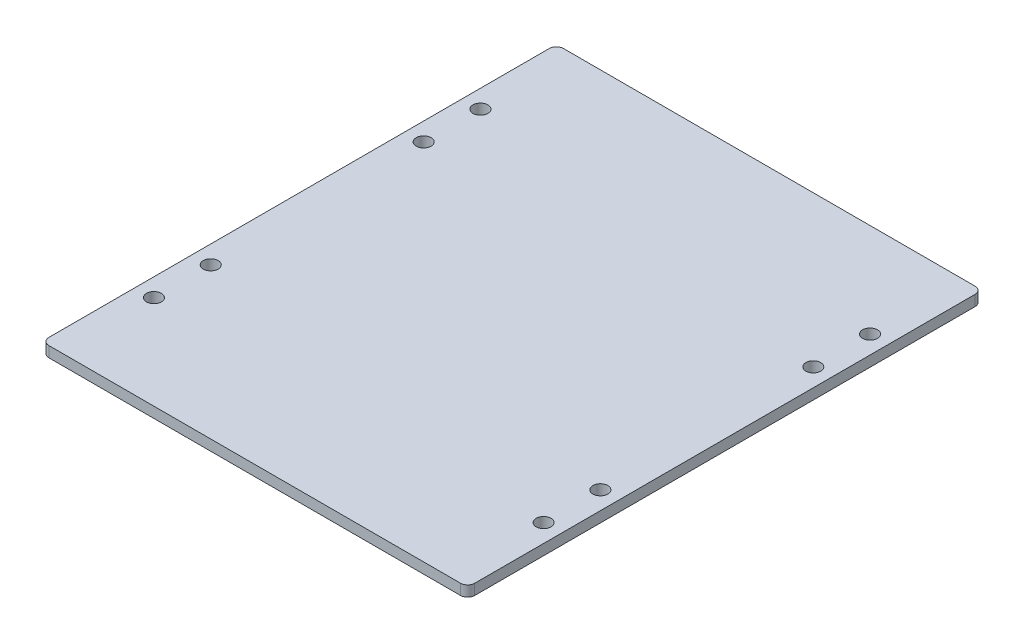
ISO-10303-21;
HEADER;
FILE_DESCRIPTION(('STEP AP214'),'2;1');
FILE_NAME('part.step','',(''),(''),'','','');
FILE_SCHEMA(('AUTOMOTIVE_DESIGN { 1 0 10303 214 1 1 1 1 }'));
ENDSEC;
DATA;
#1=APPLICATION_CONTEXT('core data for automotive mechanical design processes');
#2=APPLICATION_PROTOCOL_DEFINITION('international standard','automotive_design',2000,#1);
#3=PRODUCT_CONTEXT('',#1,'mechanical');
#4=PRODUCT('Part','Part','',(#3));
#5=PRODUCT_RELATED_PRODUCT_CATEGORY('part','',(#4));
#6=PRODUCT_DEFINITION_FORMATION('','',#4);
#7=PRODUCT_DEFINITION_CONTEXT('part definition',#1,'design');
#8=PRODUCT_DEFINITION('design','',#6,#7);
#9=PRODUCT_DEFINITION_SHAPE('','',#8);
#10=(LENGTH_UNIT() NAMED_UNIT(*) SI_UNIT(.MILLI.,.METRE.));
#11=(NAMED_UNIT(*) PLANE_ANGLE_UNIT() SI_UNIT($,.RADIAN.));
#12=(NAMED_UNIT(*) SI_UNIT($,.STERADIAN.) SOLID_ANGLE_UNIT());
#13=UNCERTAINTY_MEASURE_WITH_UNIT(LENGTH_MEASURE(1.E-05),#10,'distance_accuracy_value','');
#14=(GEOMETRIC_REPRESENTATION_CONTEXT(3) GLOBAL_UNCERTAINTY_ASSIGNED_CONTEXT((#13)) GLOBAL_UNIT_ASSIGNED_CONTEXT((#10,
#11,#12)) REPRESENTATION_CONTEXT('',''));
#15=CARTESIAN_POINT('',(0.,0.,0.));
#16=DIRECTION('',(0.,0.,1.));
#17=DIRECTION('',(1.,0.,0.));
#18=AXIS2_PLACEMENT_3D('',#15,#16,#17);
#19=CARTESIAN_POINT('',(0.,3.,0.));
#20=DIRECTION('',(1.,0.,0.));
#21=DIRECTION('',(0.,0.,-1.));
#22=AXIS2_PLACEMENT_3D('',#19,#20,#21);
#23=PLANE('',#22);
#24=DIRECTION('',(0.,0.,1.));
#25=VECTOR('',#24,1.);
#26=CARTESIAN_POINT('',(0.,3.,0.));
#27=LINE('',#26,#25);
#28=CARTESIAN_POINT('',(0.,3.,-143.));
#29=VERTEX_POINT('',#28);
#30=CARTESIAN_POINT('',(0.,3.,-2.));
#31=VERTEX_POINT('',#30);
#32=EDGE_CURVE('E117',#29,#31,#27,.T.);
#33=ORIENTED_EDGE('',*,*,#32,.F.);
#34=DIRECTION('',(0.,-1.,0.));
#35=VECTOR('',#34,1.);
#36=CARTESIAN_POINT('',(0.,3.,-143.));
#37=LINE('',#36,#35);
#38=CARTESIAN_POINT('',(0.,0.,-143.));
#39=VERTEX_POINT('',#38);
#40=EDGE_CURVE('E102',#29,#39,#37,.T.);
#41=ORIENTED_EDGE('',*,*,#40,.T.);
#42=DIRECTION('',(0.,0.,1.));
#43=VECTOR('',#42,1.);
#44=CARTESIAN_POINT('',(0.,0.,0.));
#45=LINE('',#44,#43);
#46=CARTESIAN_POINT('',(0.,0.,-2.));
#47=VERTEX_POINT('',#46);
#48=EDGE_CURVE('E114',#39,#47,#45,.T.);
#49=ORIENTED_EDGE('',*,*,#48,.T.);
#50=DIRECTION('',(0.,-1.,0.));
#51=VECTOR('',#50,1.);
#52=CARTESIAN_POINT('',(0.,3.,-2.));
#53=LINE('',#52,#51);
#54=EDGE_CURVE('E119',#47,#31,#53,.F.);
#55=ORIENTED_EDGE('',*,*,#54,.T.);
#56=EDGE_LOOP('',(#33,#41,#49,#55));
#57=FACE_BOUND('',#56,.T.);
#58=ADVANCED_FACE('F32',(#57),#23,.F.);
#59=CARTESIAN_POINT('',(0.,3.,0.));
#60=DIRECTION('',(0.,0.,-1.));
#61=DIRECTION('',(-1.,0.,0.));
#62=AXIS2_PLACEMENT_3D('',#59,#60,#61);
#63=PLANE('',#62);
#64=DIRECTION('',(1.,0.,0.));
#65=VECTOR('',#64,1.);
#66=CARTESIAN_POINT('',(0.,0.,0.));
#67=LINE('',#66,#65);
#68=CARTESIAN_POINT('',(2.,0.,0.));
#69=VERTEX_POINT('',#68);
#70=CARTESIAN_POINT('',(118.,0.,0.));
#71=VERTEX_POINT('',#70);
#72=EDGE_CURVE('E123',#69,#71,#67,.T.);
#73=ORIENTED_EDGE('',*,*,#72,.T.);
#74=DIRECTION('',(0.,-1.,0.));
#75=VECTOR('',#74,1.);
#76=CARTESIAN_POINT('',(118.,3.,0.));
#77=LINE('',#76,#75);
#78=CARTESIAN_POINT('',(118.,3.,0.));
#79=VERTEX_POINT('',#78);
#80=EDGE_CURVE('E11',#71,#79,#77,.F.);
#81=ORIENTED_EDGE('',*,*,#80,.T.);
#82=DIRECTION('',(1.,0.,0.));
#83=VECTOR('',#82,1.);
#84=CARTESIAN_POINT('',(0.,3.,0.));
#85=LINE('',#84,#83);
#86=CARTESIAN_POINT('',(2.,3.,0.));
#87=VERTEX_POINT('',#86);
#88=EDGE_CURVE('E163',#87,#79,#85,.T.);
#89=ORIENTED_EDGE('',*,*,#88,.F.);
#90=DIRECTION('',(0.,-1.,0.));
#91=VECTOR('',#90,1.);
#92=CARTESIAN_POINT('',(2.,3.,0.));
#93=LINE('',#92,#91);
#94=EDGE_CURVE('E40',#87,#69,#93,.T.);
#95=ORIENTED_EDGE('',*,*,#94,.T.);
#96=EDGE_LOOP('',(#73,#81,#89,#95));
#97=FACE_BOUND('',#96,.T.);
#98=ADVANCED_FACE('F161',(#97),#63,.F.);
#99=CARTESIAN_POINT('',(120.,3.,0.));
#100=DIRECTION('',(-1.,0.,0.));
#101=DIRECTION('',(0.,0.,1.));
#102=AXIS2_PLACEMENT_3D('',#99,#100,#101);
#103=PLANE('',#102);
#104=DIRECTION('',(0.,0.,-1.));
#105=VECTOR('',#104,1.);
#106=CARTESIAN_POINT('',(120.,0.,0.));
#107=LINE('',#106,#105);
#108=CARTESIAN_POINT('',(120.,0.,-2.));
#109=VERTEX_POINT('',#108);
#110=CARTESIAN_POINT('',(120.,0.,-143.));
#111=VERTEX_POINT('',#110);
#112=EDGE_CURVE('E127',#109,#111,#107,.T.);
#113=ORIENTED_EDGE('',*,*,#112,.T.);
#114=DIRECTION('',(0.,-1.,0.));
#115=VECTOR('',#114,1.);
#116=CARTESIAN_POINT('',(120.,3.,-143.));
#117=LINE('',#116,#115);
#118=CARTESIAN_POINT('',(120.,3.,-143.));
#119=VERTEX_POINT('',#118);
#120=EDGE_CURVE('E47',#111,#119,#117,.F.);
#121=ORIENTED_EDGE('',*,*,#120,.T.);
#122=DIRECTION('',(0.,0.,-1.));
#123=VECTOR('',#122,1.);
#124=CARTESIAN_POINT('',(120.,3.,0.));
#125=LINE('',#124,#123);
#126=CARTESIAN_POINT('',(120.,3.,-2.));
#127=VERTEX_POINT('',#126);
#128=EDGE_CURVE('E171',#127,#119,#125,.T.);
#129=ORIENTED_EDGE('',*,*,#128,.F.);
#130=DIRECTION('',(0.,-1.,0.));
#131=VECTOR('',#130,1.);
#132=CARTESIAN_POINT('',(120.,3.,-2.));
#133=LINE('',#132,#131);
#134=EDGE_CURVE('E154',#127,#109,#133,.T.);
#135=ORIENTED_EDGE('',*,*,#134,.T.);
#136=EDGE_LOOP('',(#113,#121,#129,#135));
#137=FACE_BOUND('',#136,.T.);
#138=ADVANCED_FACE('F170',(#137),#103,.F.);
#139=CARTESIAN_POINT('',(0.,3.,-145.));
#140=DIRECTION('',(0.,0.,1.));
#141=DIRECTION('',(1.,0.,0.));
#142=AXIS2_PLACEMENT_3D('',#139,#140,#141);
#143=PLANE('',#142);
#144=DIRECTION('',(-1.,0.,0.));
#145=VECTOR('',#144,1.);
#146=CARTESIAN_POINT('',(0.,0.,-145.));
#147=LINE('',#146,#145);
#148=CARTESIAN_POINT('',(118.,0.,-145.));
#149=VERTEX_POINT('',#148);
#150=CARTESIAN_POINT('',(2.,0.,-145.));
#151=VERTEX_POINT('',#150);
#152=EDGE_CURVE('E137',#149,#151,#147,.T.);
#153=ORIENTED_EDGE('',*,*,#152,.T.);
#154=DIRECTION('',(0.,-1.,0.));
#155=VECTOR('',#154,1.);
#156=CARTESIAN_POINT('',(2.,3.,-145.));
#157=LINE('',#156,#155);
#158=CARTESIAN_POINT('',(2.,3.,-145.));
#159=VERTEX_POINT('',#158);
#160=EDGE_CURVE('E103',#151,#159,#157,.F.);
#161=ORIENTED_EDGE('',*,*,#160,.T.);
#162=DIRECTION('',(-1.,0.,0.));
#163=VECTOR('',#162,1.);
#164=CARTESIAN_POINT('',(0.,3.,-145.));
#165=LINE('',#164,#163);
#166=CARTESIAN_POINT('',(118.,3.,-145.));
#167=VERTEX_POINT('',#166);
#168=EDGE_CURVE('E133',#167,#159,#165,.T.);
#169=ORIENTED_EDGE('',*,*,#168,.F.);
#170=DIRECTION('',(0.,-1.,0.));
#171=VECTOR('',#170,1.);
#172=CARTESIAN_POINT('',(118.,3.,-145.));
#173=LINE('',#172,#171);
#174=EDGE_CURVE('E108',#167,#149,#173,.T.);
#175=ORIENTED_EDGE('',*,*,#174,.T.);
#176=EDGE_LOOP('',(#153,#161,#169,#175));
#177=FACE_BOUND('',#176,.T.);
#178=ADVANCED_FACE('F235',(#177),#143,.F.);
#179=CARTESIAN_POINT('',(0.,3.,0.));
#180=DIRECTION('',(0.,-1.,0.));
#181=DIRECTION('',(0.,0.,-1.));
#182=AXIS2_PLACEMENT_3D('',#179,#180,#181);
#183=PLANE('',#182);
#184=CARTESIAN_POINT('',(5.09999999999999,3.,-102.5));
#185=DIRECTION('',(0.,1.,0.));
#186=DIRECTION('',(0.,0.,1.));
#187=AXIS2_PLACEMENT_3D('',#184,#185,#186);
#188=CIRCLE('',#187,2.10000000000001);
#189=CARTESIAN_POINT('',(5.09999999999999,3.,-100.4));
#190=VERTEX_POINT('',#189);
#191=EDGE_CURVE('E199',#190,#190,#188,.T.);
#192=ORIENTED_EDGE('',*,*,#191,.F.);
#193=EDGE_LOOP('',(#192));
#194=FACE_BOUND('',#193,.T.);
#195=CARTESIAN_POINT('',(5.10000000000001,3.,-42.5));
#196=DIRECTION('',(0.,1.,0.));
#197=DIRECTION('',(0.,0.,1.));
#198=AXIS2_PLACEMENT_3D('',#195,#196,#197);
#199=CIRCLE('',#198,2.1);
#200=CARTESIAN_POINT('',(5.10000000000001,3.,-40.4));
#201=VERTEX_POINT('',#200);
#202=EDGE_CURVE('E193',#201,#201,#199,.T.);
#203=ORIENTED_EDGE('',*,*,#202,.F.);
#204=EDGE_LOOP('',(#203));
#205=FACE_BOUND('',#204,.T.);
#206=CARTESIAN_POINT('',(5.1,3.,-26.5));
#207=DIRECTION('',(0.,1.,0.));
#208=DIRECTION('',(0.,0.,1.));
#209=AXIS2_PLACEMENT_3D('',#206,#207,#208);
#210=CIRCLE('',#209,2.1);
#211=CARTESIAN_POINT('',(5.1,3.,-24.4));
#212=VERTEX_POINT('',#211);
#213=EDGE_CURVE('E187',#212,#212,#210,.T.);
#214=ORIENTED_EDGE('',*,*,#213,.F.);
#215=EDGE_LOOP('',(#214));
#216=FACE_BOUND('',#215,.T.);
#217=CARTESIAN_POINT('',(114.9,3.,-26.5));
#218=DIRECTION('',(0.,1.,0.));
#219=DIRECTION('',(0.,0.,1.));
#220=AXIS2_PLACEMENT_3D('',#217,#218,#219);
#221=CIRCLE('',#220,2.1);
#222=CARTESIAN_POINT('',(114.9,3.,-24.4));
#223=VERTEX_POINT('',#222);
#224=EDGE_CURVE('E180',#223,#223,#221,.T.);
#225=ORIENTED_EDGE('',*,*,#224,.F.);
#226=EDGE_LOOP('',(#225));
#227=FACE_BOUND('',#226,.T.);
#228=CARTESIAN_POINT('',(114.9,3.,-42.5));
#229=DIRECTION('',(0.,1.,0.));
#230=DIRECTION('',(0.,0.,1.));
#231=AXIS2_PLACEMENT_3D('',#228,#229,#230);
#232=CIRCLE('',#231,2.1);
#233=CARTESIAN_POINT('',(114.9,3.,-40.4));
#234=VERTEX_POINT('',#233);
#235=EDGE_CURVE('E216',#234,#234,#232,.T.);
#236=ORIENTED_EDGE('',*,*,#235,.F.);
#237=EDGE_LOOP('',(#236));
#238=FACE_BOUND('',#237,.T.);
#239=CARTESIAN_POINT('',(114.9,3.,-102.5));
#240=DIRECTION('',(0.,1.,0.));
#241=DIRECTION('',(0.,0.,1.));
#242=AXIS2_PLACEMENT_3D('',#239,#240,#241);
#243=CIRCLE('',#242,2.1);
#244=CARTESIAN_POINT('',(114.9,3.,-100.4));
#245=VERTEX_POINT('',#244);
#246=EDGE_CURVE('E210',#245,#245,#243,.T.);
#247=ORIENTED_EDGE('',*,*,#246,.F.);
#248=EDGE_LOOP('',(#247));
#249=FACE_BOUND('',#248,.T.);
#250=CARTESIAN_POINT('',(114.9,3.,-118.5));
#251=DIRECTION('',(0.,1.,0.));
#252=DIRECTION('',(0.,0.,1.));
#253=AXIS2_PLACEMENT_3D('',#250,#251,#252);
#254=CIRCLE('',#253,2.1);
#255=CARTESIAN_POINT('',(114.9,3.,-116.4));
#256=VERTEX_POINT('',#255);
#257=EDGE_CURVE('E204',#256,#256,#254,.T.);
#258=ORIENTED_EDGE('',*,*,#257,.F.);
#259=EDGE_LOOP('',(#258));
#260=FACE_BOUND('',#259,.T.);
#261=CARTESIAN_POINT('',(5.1,3.,-118.5));
#262=DIRECTION('',(0.,1.,0.));
#263=DIRECTION('',(0.,0.,1.));
#264=AXIS2_PLACEMENT_3D('',#261,#262,#263);
#265=CIRCLE('',#264,2.1);
#266=CARTESIAN_POINT('',(5.1,3.,-116.4));
#267=VERTEX_POINT('',#266);
#268=EDGE_CURVE('E130',#267,#267,#265,.T.);
#269=ORIENTED_EDGE('',*,*,#268,.F.);
#270=EDGE_LOOP('',(#269));
#271=FACE_BOUND('',#270,.T.);
#272=ORIENTED_EDGE('',*,*,#168,.T.);
#273=CARTESIAN_POINT('',(2.,3.,-143.));
#274=DIRECTION('',(0.,-1.,0.));
#275=DIRECTION('',(0.,0.,-1.));
#276=AXIS2_PLACEMENT_3D('',#273,#274,#275);
#277=CIRCLE('',#276,2.);
#278=EDGE_CURVE('E152',#159,#29,#277,.F.);
#279=ORIENTED_EDGE('',*,*,#278,.T.);
#280=ORIENTED_EDGE('',*,*,#32,.T.);
#281=CARTESIAN_POINT('',(2.,3.,-2.));
#282=DIRECTION('',(0.,-1.,0.));
#283=DIRECTION('',(0.,0.,-1.));
#284=AXIS2_PLACEMENT_3D('',#281,#282,#283);
#285=CIRCLE('',#284,2.);
#286=EDGE_CURVE('E147',#31,#87,#285,.F.);
#287=ORIENTED_EDGE('',*,*,#286,.T.);
#288=ORIENTED_EDGE('',*,*,#88,.T.);
#289=CARTESIAN_POINT('',(118.,3.,-2.));
#290=DIRECTION('',(0.,-1.,0.));
#291=DIRECTION('',(0.,0.,-1.));
#292=AXIS2_PLACEMENT_3D('',#289,#290,#291);
#293=CIRCLE('',#292,2.);
#294=EDGE_CURVE('E54',#79,#127,#293,.F.);
#295=ORIENTED_EDGE('',*,*,#294,.T.);
#296=ORIENTED_EDGE('',*,*,#128,.T.);
#297=CARTESIAN_POINT('',(118.,3.,-143.));
#298=DIRECTION('',(0.,-1.,0.));
#299=DIRECTION('',(0.,0.,-1.));
#300=AXIS2_PLACEMENT_3D('',#297,#298,#299);
#301=CIRCLE('',#300,2.);
#302=EDGE_CURVE('E150',#119,#167,#301,.F.);
#303=ORIENTED_EDGE('',*,*,#302,.T.);
#304=EDGE_LOOP('',(#272,#279,#280,#287,#288,#295,#296,#303));
#305=FACE_BOUND('',#304,.T.);
#306=ADVANCED_FACE('F232',(#194,#205,#216,#227,#238,#249,#260,#271,#305),#183,.F.);
#307=CARTESIAN_POINT('',(0.,0.,0.));
#308=DIRECTION('',(0.,-1.,0.));
#309=DIRECTION('',(0.,0.,-1.));
#310=AXIS2_PLACEMENT_3D('',#307,#308,#309);
#311=PLANE('',#310);
#312=CARTESIAN_POINT('',(5.09999999999999,0.,-102.5));
#313=DIRECTION('',(0.,1.,0.));
#314=DIRECTION('',(0.,0.,1.));
#315=AXIS2_PLACEMENT_3D('',#312,#313,#314);
#316=CIRCLE('',#315,2.10000000000001);
#317=CARTESIAN_POINT('',(5.09999999999999,0.,-100.4));
#318=VERTEX_POINT('',#317);
#319=EDGE_CURVE('E178',#318,#318,#316,.T.);
#320=ORIENTED_EDGE('',*,*,#319,.T.);
#321=EDGE_LOOP('',(#320));
#322=FACE_BOUND('',#321,.T.);
#323=CARTESIAN_POINT('',(5.10000000000001,0.,-42.5));
#324=DIRECTION('',(0.,1.,0.));
#325=DIRECTION('',(0.,0.,1.));
#326=AXIS2_PLACEMENT_3D('',#323,#324,#325);
#327=CIRCLE('',#326,2.1);
#328=CARTESIAN_POINT('',(5.10000000000001,0.,-40.4));
#329=VERTEX_POINT('',#328);
#330=EDGE_CURVE('E196',#329,#329,#327,.T.);
#331=ORIENTED_EDGE('',*,*,#330,.T.);
#332=EDGE_LOOP('',(#331));
#333=FACE_BOUND('',#332,.T.);
#334=CARTESIAN_POINT('',(5.1,0.,-26.5));
#335=DIRECTION('',(0.,1.,0.));
#336=DIRECTION('',(0.,0.,1.));
#337=AXIS2_PLACEMENT_3D('',#334,#335,#336);
#338=CIRCLE('',#337,2.1);
#339=CARTESIAN_POINT('',(5.1,0.,-24.4));
#340=VERTEX_POINT('',#339);
#341=EDGE_CURVE('E190',#340,#340,#338,.T.);
#342=ORIENTED_EDGE('',*,*,#341,.T.);
#343=EDGE_LOOP('',(#342));
#344=FACE_BOUND('',#343,.T.);
#345=CARTESIAN_POINT('',(114.9,0.,-26.5));
#346=DIRECTION('',(0.,1.,0.));
#347=DIRECTION('',(0.,0.,1.));
#348=AXIS2_PLACEMENT_3D('',#345,#346,#347);
#349=CIRCLE('',#348,2.1);
#350=CARTESIAN_POINT('',(114.9,0.,-24.4));
#351=VERTEX_POINT('',#350);
#352=EDGE_CURVE('E183',#351,#351,#349,.T.);
#353=ORIENTED_EDGE('',*,*,#352,.T.);
#354=EDGE_LOOP('',(#353));
#355=FACE_BOUND('',#354,.T.);
#356=CARTESIAN_POINT('',(114.9,0.,-42.5));
#357=DIRECTION('',(0.,1.,0.));
#358=DIRECTION('',(0.,0.,1.));
#359=AXIS2_PLACEMENT_3D('',#356,#357,#358);
#360=CIRCLE('',#359,2.1);
#361=CARTESIAN_POINT('',(114.9,0.,-40.4));
#362=VERTEX_POINT('',#361);
#363=EDGE_CURVE('E184',#362,#362,#360,.T.);
#364=ORIENTED_EDGE('',*,*,#363,.T.);
#365=EDGE_LOOP('',(#364));
#366=FACE_BOUND('',#365,.T.);
#367=CARTESIAN_POINT('',(114.9,0.,-102.5));
#368=DIRECTION('',(0.,1.,0.));
#369=DIRECTION('',(0.,0.,1.));
#370=AXIS2_PLACEMENT_3D('',#367,#368,#369);
#371=CIRCLE('',#370,2.1);
#372=CARTESIAN_POINT('',(114.9,0.,-100.4));
#373=VERTEX_POINT('',#372);
#374=EDGE_CURVE('E213',#373,#373,#371,.T.);
#375=ORIENTED_EDGE('',*,*,#374,.T.);
#376=EDGE_LOOP('',(#375));
#377=FACE_BOUND('',#376,.T.);
#378=CARTESIAN_POINT('',(114.9,0.,-118.5));
#379=DIRECTION('',(0.,1.,0.));
#380=DIRECTION('',(0.,0.,1.));
#381=AXIS2_PLACEMENT_3D('',#378,#379,#380);
#382=CIRCLE('',#381,2.1);
#383=CARTESIAN_POINT('',(114.9,0.,-116.4));
#384=VERTEX_POINT('',#383);
#385=EDGE_CURVE('E207',#384,#384,#382,.T.);
#386=ORIENTED_EDGE('',*,*,#385,.T.);
#387=EDGE_LOOP('',(#386));
#388=FACE_BOUND('',#387,.T.);
#389=CARTESIAN_POINT('',(5.1,0.,-118.5));
#390=DIRECTION('',(0.,1.,0.));
#391=DIRECTION('',(0.,0.,1.));
#392=AXIS2_PLACEMENT_3D('',#389,#390,#391);
#393=CIRCLE('',#392,2.1);
#394=CARTESIAN_POINT('',(5.1,0.,-116.4));
#395=VERTEX_POINT('',#394);
#396=EDGE_CURVE('E124',#395,#395,#393,.T.);
#397=ORIENTED_EDGE('',*,*,#396,.T.);
#398=EDGE_LOOP('',(#397));
#399=FACE_BOUND('',#398,.T.);
#400=ORIENTED_EDGE('',*,*,#48,.F.);
#401=CARTESIAN_POINT('',(2.,0.,-143.));
#402=DIRECTION('',(0.,-1.,0.));
#403=DIRECTION('',(0.,0.,-1.));
#404=AXIS2_PLACEMENT_3D('',#401,#402,#403);
#405=CIRCLE('',#404,2.);
#406=EDGE_CURVE('E98',#39,#151,#405,.T.);
#407=ORIENTED_EDGE('',*,*,#406,.T.);
#408=ORIENTED_EDGE('',*,*,#152,.F.);
#409=CARTESIAN_POINT('',(118.,0.,-143.));
#410=DIRECTION('',(0.,-1.,0.));
#411=DIRECTION('',(0.,0.,-1.));
#412=AXIS2_PLACEMENT_3D('',#409,#410,#411);
#413=CIRCLE('',#412,2.);
#414=EDGE_CURVE('E109',#149,#111,#413,.T.);
#415=ORIENTED_EDGE('',*,*,#414,.T.);
#416=ORIENTED_EDGE('',*,*,#112,.F.);
#417=CARTESIAN_POINT('',(118.,0.,-2.));
#418=DIRECTION('',(0.,-1.,0.));
#419=DIRECTION('',(0.,0.,-1.));
#420=AXIS2_PLACEMENT_3D('',#417,#418,#419);
#421=CIRCLE('',#420,2.);
#422=EDGE_CURVE('E141',#109,#71,#421,.T.);
#423=ORIENTED_EDGE('',*,*,#422,.T.);
#424=ORIENTED_EDGE('',*,*,#72,.F.);
#425=CARTESIAN_POINT('',(2.,0.,-2.));
#426=DIRECTION('',(0.,-1.,0.));
#427=DIRECTION('',(0.,0.,-1.));
#428=AXIS2_PLACEMENT_3D('',#425,#426,#427);
#429=CIRCLE('',#428,2.);
#430=EDGE_CURVE('E118',#69,#47,#429,.T.);
#431=ORIENTED_EDGE('',*,*,#430,.T.);
#432=EDGE_LOOP('',(#400,#407,#408,#415,#416,#423,#424,#431));
#433=FACE_BOUND('',#432,.T.);
#434=ADVANCED_FACE('F121',(#322,#333,#344,#355,#366,#377,#388,#399,#433),#311,.T.);
#435=CARTESIAN_POINT('',(5.1,0.,-118.5));
#436=DIRECTION('',(0.,1.,0.));
#437=DIRECTION('',(0.,0.,1.));
#438=AXIS2_PLACEMENT_3D('',#435,#436,#437);
#439=CYLINDRICAL_SURFACE('',#438,2.1);
#440=ORIENTED_EDGE('',*,*,#396,.F.);
#441=EDGE_LOOP('',(#440));
#442=FACE_BOUND('',#441,.T.);
#443=ORIENTED_EDGE('',*,*,#268,.T.);
#444=EDGE_LOOP('',(#443));
#445=FACE_BOUND('',#444,.T.);
#446=ADVANCED_FACE('F268',(#442,#445),#439,.F.);
#447=CARTESIAN_POINT('',(114.9,0.,-118.5));
#448=DIRECTION('',(0.,1.,0.));
#449=DIRECTION('',(0.,0.,1.));
#450=AXIS2_PLACEMENT_3D('',#447,#448,#449);
#451=CYLINDRICAL_SURFACE('',#450,2.1);
#452=ORIENTED_EDGE('',*,*,#385,.F.);
#453=EDGE_LOOP('',(#452));
#454=FACE_BOUND('',#453,.T.);
#455=ORIENTED_EDGE('',*,*,#257,.T.);
#456=EDGE_LOOP('',(#455));
#457=FACE_BOUND('',#456,.T.);
#458=ADVANCED_FACE('F273',(#454,#457),#451,.F.);
#459=CARTESIAN_POINT('',(114.9,0.,-102.5));
#460=DIRECTION('',(0.,1.,0.));
#461=DIRECTION('',(0.,0.,1.));
#462=AXIS2_PLACEMENT_3D('',#459,#460,#461);
#463=CYLINDRICAL_SURFACE('',#462,2.1);
#464=ORIENTED_EDGE('',*,*,#374,.F.);
#465=EDGE_LOOP('',(#464));
#466=FACE_BOUND('',#465,.T.);
#467=ORIENTED_EDGE('',*,*,#246,.T.);
#468=EDGE_LOOP('',(#467));
#469=FACE_BOUND('',#468,.T.);
#470=ADVANCED_FACE('F228',(#466,#469),#463,.F.);
#471=CARTESIAN_POINT('',(114.9,0.,-42.5));
#472=DIRECTION('',(0.,1.,0.));
#473=DIRECTION('',(0.,0.,1.));
#474=AXIS2_PLACEMENT_3D('',#471,#472,#473);
#475=CYLINDRICAL_SURFACE('',#474,2.1);
#476=ORIENTED_EDGE('',*,*,#363,.F.);
#477=EDGE_LOOP('',(#476));
#478=FACE_BOUND('',#477,.T.);
#479=ORIENTED_EDGE('',*,*,#235,.T.);
#480=EDGE_LOOP('',(#479));
#481=FACE_BOUND('',#480,.T.);
#482=ADVANCED_FACE('F224',(#478,#481),#475,.F.);
#483=CARTESIAN_POINT('',(114.9,0.,-26.5));
#484=DIRECTION('',(0.,1.,0.));
#485=DIRECTION('',(0.,0.,1.));
#486=AXIS2_PLACEMENT_3D('',#483,#484,#485);
#487=CYLINDRICAL_SURFACE('',#486,2.1);
#488=ORIENTED_EDGE('',*,*,#352,.F.);
#489=EDGE_LOOP('',(#488));
#490=FACE_BOUND('',#489,.T.);
#491=ORIENTED_EDGE('',*,*,#224,.T.);
#492=EDGE_LOOP('',(#491));
#493=FACE_BOUND('',#492,.T.);
#494=ADVANCED_FACE('F227',(#490,#493),#487,.F.);
#495=CARTESIAN_POINT('',(5.1,0.,-26.5));
#496=DIRECTION('',(0.,1.,0.));
#497=DIRECTION('',(0.,0.,1.));
#498=AXIS2_PLACEMENT_3D('',#495,#496,#497);
#499=CYLINDRICAL_SURFACE('',#498,2.1);
#500=ORIENTED_EDGE('',*,*,#341,.F.);
#501=EDGE_LOOP('',(#500));
#502=FACE_BOUND('',#501,.T.);
#503=ORIENTED_EDGE('',*,*,#213,.T.);
#504=EDGE_LOOP('',(#503));
#505=FACE_BOUND('',#504,.T.);
#506=ADVANCED_FACE('F277',(#502,#505),#499,.F.);
#507=CARTESIAN_POINT('',(5.10000000000001,0.,-42.5));
#508=DIRECTION('',(0.,1.,0.));
#509=DIRECTION('',(0.,0.,1.));
#510=AXIS2_PLACEMENT_3D('',#507,#508,#509);
#511=CYLINDRICAL_SURFACE('',#510,2.1);
#512=ORIENTED_EDGE('',*,*,#330,.F.);
#513=EDGE_LOOP('',(#512));
#514=FACE_BOUND('',#513,.T.);
#515=ORIENTED_EDGE('',*,*,#202,.T.);
#516=EDGE_LOOP('',(#515));
#517=FACE_BOUND('',#516,.T.);
#518=ADVANCED_FACE('F281',(#514,#517),#511,.F.);
#519=CARTESIAN_POINT('',(5.09999999999999,0.,-102.5));
#520=DIRECTION('',(0.,1.,0.));
#521=DIRECTION('',(0.,0.,1.));
#522=AXIS2_PLACEMENT_3D('',#519,#520,#521);
#523=CYLINDRICAL_SURFACE('',#522,2.10000000000001);
#524=ORIENTED_EDGE('',*,*,#319,.F.);
#525=EDGE_LOOP('',(#524));
#526=FACE_BOUND('',#525,.T.);
#527=ORIENTED_EDGE('',*,*,#191,.T.);
#528=EDGE_LOOP('',(#527));
#529=FACE_BOUND('',#528,.T.);
#530=ADVANCED_FACE('F254',(#526,#529),#523,.F.);
#531=CARTESIAN_POINT('',(2.,3.,-143.));
#532=DIRECTION('',(0.,-1.,0.));
#533=DIRECTION('',(0.,0.,-1.));
#534=AXIS2_PLACEMENT_3D('',#531,#532,#533);
#535=CYLINDRICAL_SURFACE('',#534,2.);
#536=ORIENTED_EDGE('',*,*,#278,.F.);
#537=ORIENTED_EDGE('',*,*,#160,.F.);
#538=ORIENTED_EDGE('',*,*,#406,.F.);
#539=ORIENTED_EDGE('',*,*,#40,.F.);
#540=EDGE_LOOP('',(#536,#537,#538,#539));
#541=FACE_BOUND('',#540,.T.);
#542=ADVANCED_FACE('F101',(#541),#535,.T.);
#543=CARTESIAN_POINT('',(118.,3.,-143.));
#544=DIRECTION('',(0.,-1.,0.));
#545=DIRECTION('',(0.,0.,-1.));
#546=AXIS2_PLACEMENT_3D('',#543,#544,#545);
#547=CYLINDRICAL_SURFACE('',#546,2.);
#548=ORIENTED_EDGE('',*,*,#302,.F.);
#549=ORIENTED_EDGE('',*,*,#120,.F.);
#550=ORIENTED_EDGE('',*,*,#414,.F.);
#551=ORIENTED_EDGE('',*,*,#174,.F.);
#552=EDGE_LOOP('',(#548,#549,#550,#551));
#553=FACE_BOUND('',#552,.T.);
#554=ADVANCED_FACE('F247',(#553),#547,.T.);
#555=CARTESIAN_POINT('',(118.,3.,-2.));
#556=DIRECTION('',(0.,-1.,0.));
#557=DIRECTION('',(0.,0.,-1.));
#558=AXIS2_PLACEMENT_3D('',#555,#556,#557);
#559=CYLINDRICAL_SURFACE('',#558,2.);
#560=ORIENTED_EDGE('',*,*,#294,.F.);
#561=ORIENTED_EDGE('',*,*,#80,.F.);
#562=ORIENTED_EDGE('',*,*,#422,.F.);
#563=ORIENTED_EDGE('',*,*,#134,.F.);
#564=EDGE_LOOP('',(#560,#561,#562,#563));
#565=FACE_BOUND('',#564,.T.);
#566=ADVANCED_FACE('F169',(#565),#559,.T.);
#567=CARTESIAN_POINT('',(2.,3.,-2.));
#568=DIRECTION('',(0.,-1.,0.));
#569=DIRECTION('',(0.,0.,-1.));
#570=AXIS2_PLACEMENT_3D('',#567,#568,#569);
#571=CYLINDRICAL_SURFACE('',#570,2.);
#572=ORIENTED_EDGE('',*,*,#286,.F.);
#573=ORIENTED_EDGE('',*,*,#54,.F.);
#574=ORIENTED_EDGE('',*,*,#430,.F.);
#575=ORIENTED_EDGE('',*,*,#94,.F.);
#576=EDGE_LOOP('',(#572,#573,#574,#575));
#577=FACE_BOUND('',#576,.T.);
#578=ADVANCED_FACE('F34',(#577),#571,.T.);
#579=CLOSED_SHELL('',(#58,#98,#138,#178,#306,#434,#446,#458,#470,#482,#494,#506,#518,#530,#542,
#554,#566,#578));
#580=MANIFOLD_SOLID_BREP('B2',#579);
#581=ADVANCED_BREP_SHAPE_REPRESENTATION('',(#18,#580),#14);
#582=SHAPE_DEFINITION_REPRESENTATION(#9,#581);
ENDSEC;
END-ISO-10303-21;
